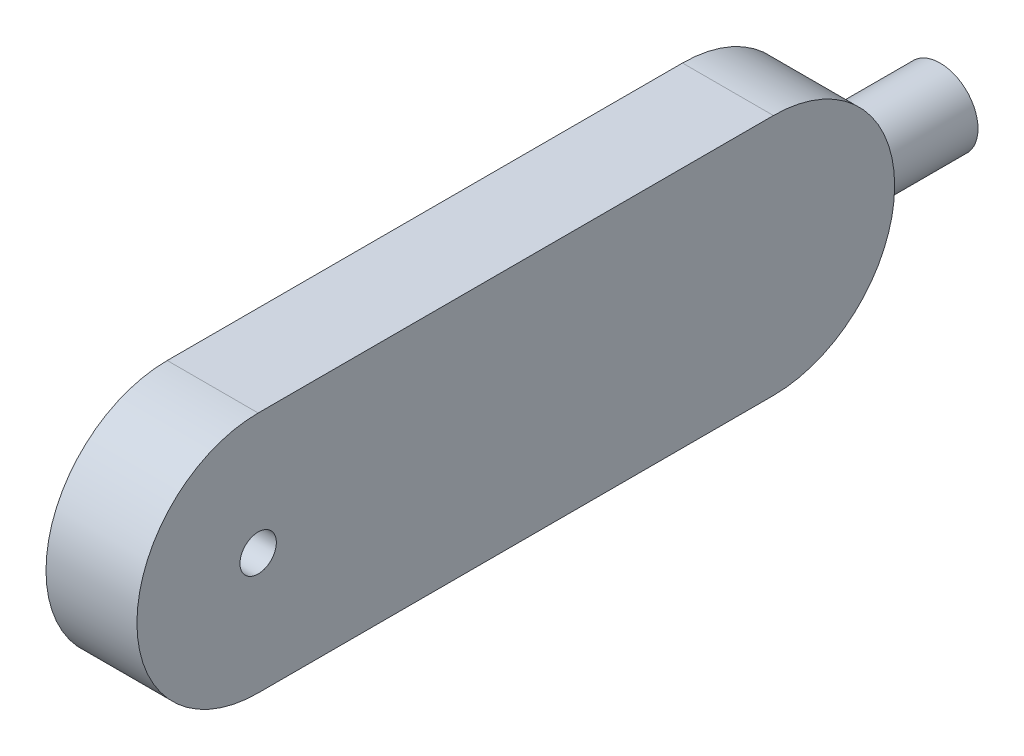
ISO-10303-21;
HEADER;
FILE_DESCRIPTION(('STEP AP214'),'2;1');
FILE_NAME('part.step','',(''),(''),'','','');
FILE_SCHEMA(('AUTOMOTIVE_DESIGN { 1 0 10303 214 1 1 1 1 }'));
ENDSEC;
DATA;
#1=APPLICATION_CONTEXT('core data for automotive mechanical design processes');
#2=APPLICATION_PROTOCOL_DEFINITION('international standard','automotive_design',2000,#1);
#3=PRODUCT_CONTEXT('',#1,'mechanical');
#4=PRODUCT('Part','Part','',(#3));
#5=PRODUCT_RELATED_PRODUCT_CATEGORY('part','',(#4));
#6=PRODUCT_DEFINITION_FORMATION('','',#4);
#7=PRODUCT_DEFINITION_CONTEXT('part definition',#1,'design');
#8=PRODUCT_DEFINITION('design','',#6,#7);
#9=PRODUCT_DEFINITION_SHAPE('','',#8);
#10=(LENGTH_UNIT() NAMED_UNIT(*) SI_UNIT(.MILLI.,.METRE.));
#11=(NAMED_UNIT(*) PLANE_ANGLE_UNIT() SI_UNIT($,.RADIAN.));
#12=(NAMED_UNIT(*) SI_UNIT($,.STERADIAN.) SOLID_ANGLE_UNIT());
#13=UNCERTAINTY_MEASURE_WITH_UNIT(LENGTH_MEASURE(1.E-05),#10,'distance_accuracy_value','');
#14=(GEOMETRIC_REPRESENTATION_CONTEXT(3) GLOBAL_UNCERTAINTY_ASSIGNED_CONTEXT((#13)) GLOBAL_UNIT_ASSIGNED_CONTEXT((#10,
#11,#12)) REPRESENTATION_CONTEXT('',''));
#15=CARTESIAN_POINT('',(0.,0.,0.));
#16=DIRECTION('',(0.,0.,1.));
#17=DIRECTION('',(1.,0.,0.));
#18=AXIS2_PLACEMENT_3D('',#15,#16,#17);
#19=CARTESIAN_POINT('',(30.,40.,-210.));
#20=DIRECTION('',(-1.,0.,0.));
#21=DIRECTION('',(0.,0.,1.));
#22=AXIS2_PLACEMENT_3D('',#19,#20,#21);
#23=CYLINDRICAL_SURFACE('',#22,40.);
#24=CARTESIAN_POINT('',(30.,40.,-210.));
#25=DIRECTION('',(-1.,0.,0.));
#26=DIRECTION('',(0.,0.,1.));
#27=AXIS2_PLACEMENT_3D('',#24,#25,#26);
#28=CIRCLE('',#27,40.);
#29=CARTESIAN_POINT('',(30.,80.0000000000001,-210.));
#30=VERTEX_POINT('',#29);
#31=CARTESIAN_POINT('',(30.,0.,-210.));
#32=VERTEX_POINT('',#31);
#33=EDGE_CURVE('E44',#30,#32,#28,.T.);
#34=ORIENTED_EDGE('',*,*,#33,.T.);
#35=DIRECTION('',(-1.,0.,0.));
#36=VECTOR('',#35,1.);
#37=CARTESIAN_POINT('',(30.,0.,-210.));
#38=LINE('',#37,#36);
#39=CARTESIAN_POINT('',(0.,0.,-210.));
#40=VERTEX_POINT('',#39);
#41=EDGE_CURVE('E11',#32,#40,#38,.T.);
#42=ORIENTED_EDGE('',*,*,#41,.T.);
#43=CARTESIAN_POINT('',(0.,40.,-210.));
#44=DIRECTION('',(-1.,0.,0.));
#45=DIRECTION('',(0.,0.,1.));
#46=AXIS2_PLACEMENT_3D('',#43,#44,#45);
#47=CIRCLE('',#46,40.);
#48=CARTESIAN_POINT('',(0.,80.0000000000001,-210.));
#49=VERTEX_POINT('',#48);
#50=EDGE_CURVE('E162',#49,#40,#47,.T.);
#51=ORIENTED_EDGE('',*,*,#50,.F.);
#52=DIRECTION('',(-1.,0.,0.));
#53=VECTOR('',#52,1.);
#54=CARTESIAN_POINT('',(30.,80.0000000000001,-210.));
#55=LINE('',#54,#53);
#56=EDGE_CURVE('E169',#30,#49,#55,.T.);
#57=ORIENTED_EDGE('',*,*,#56,.F.);
#58=EDGE_LOOP('',(#34,#42,#51,#57));
#59=FACE_BOUND('',#58,.T.);
#60=CARTESIAN_POINT('',(27.5,40.,-250.));
#61=CARTESIAN_POINT('',(27.4999996056617,40.342204552625,-249.999999737702));
#62=CARTESIAN_POINT('',(27.4859360558347,40.6844158773741,-249.995598289629));
#63=CARTESIAN_POINT('',(27.4298121177631,41.3663139805722,-249.978113060104));
#64=CARTESIAN_POINT('',(27.3877509946712,41.7060006925214,-249.965029050762));
#65=CARTESIAN_POINT('',(27.2760089579981,42.3804335728738,-249.930534374627));
#66=CARTESIAN_POINT('',(27.2063227786749,42.7151787867296,-249.909122120363));
#67=CARTESIAN_POINT('',(27.0399529136372,43.3772850049059,-249.858552315762));
#68=CARTESIAN_POINT('',(26.9432692872638,43.7046460254554,-249.82939478245));
#69=CARTESIAN_POINT('',(26.7239019769875,44.3492353136851,-249.764166487275));
#70=CARTESIAN_POINT('',(26.6012596911088,44.6664788003717,-249.728106741495));
#71=CARTESIAN_POINT('',(26.3308665018371,45.2893028500472,-249.649991067217));
#72=CARTESIAN_POINT('',(26.1831156136602,45.5948834201039,-249.607935142354));
#73=CARTESIAN_POINT('',(25.8636222369973,46.1924551322176,-249.518916494033));
#74=CARTESIAN_POINT('',(25.6918811169035,46.4844470480999,-249.471954050479));
#75=CARTESIAN_POINT('',(25.3255404162271,47.0532038603043,-249.374301459257));
#76=CARTESIAN_POINT('',(25.1309326575645,47.3299632565498,-249.323609980365));
#77=CARTESIAN_POINT('',(24.7144977557807,47.8739500199095,-249.218360192221));
#78=CARTESIAN_POINT('',(24.4920665758335,48.1407019314077,-249.163733706781));
#79=CARTESIAN_POINT('',(24.0259170027536,48.6546630298969,-249.053372579667));
#80=CARTESIAN_POINT('',(23.7821982016919,48.9018718422158,-248.997637916774));
#81=CARTESIAN_POINT('',(23.2749138770081,49.3752977293698,-248.886539375386));
#82=CARTESIAN_POINT('',(23.0113413821741,49.6015073679558,-248.831175634635));
#83=CARTESIAN_POINT('',(22.4661391038643,50.0313120377644,-248.722369752953));
#84=CARTESIAN_POINT('',(22.1845155752643,50.2349148363934,-248.668926956308));
#85=CARTESIAN_POINT('',(21.5976102981265,50.6230112633002,-248.564142024417));
#86=CARTESIAN_POINT('',(21.2919135086141,50.8069011314766,-248.512885608538));
#87=CARTESIAN_POINT('',(20.6652746853971,51.1481814348208,-248.415485942598));
#88=CARTESIAN_POINT('',(20.344332335376,51.3055713198557,-248.369342798695));
#89=CARTESIAN_POINT('',(19.6894644343749,51.5925273433765,-248.283622425114));
#90=CARTESIAN_POINT('',(19.3555415678269,51.7220991989871,-248.244043846677));
#91=CARTESIAN_POINT('',(18.6770519302637,51.9523055811873,-248.172724982613));
#92=CARTESIAN_POINT('',(18.3324855747744,52.0529412358802,-248.140984391423));
#93=CARTESIAN_POINT('',(17.6458035706646,52.2217405426102,-248.087224505286));
#94=CARTESIAN_POINT('',(17.3039263995051,52.2907905162333,-248.064941329643));
#95=CARTESIAN_POINT('',(16.6151328454856,52.4001182283762,-248.029467304444));
#96=CARTESIAN_POINT('',(16.2682165557117,52.4403964976996,-248.016276287147));
#97=CARTESIAN_POINT('',(15.5720789022629,52.4917777483029,-247.999423981715));
#98=CARTESIAN_POINT('',(15.2228580882163,52.5028874508925,-247.995760498152));
#99=CARTESIAN_POINT('',(14.5247486376196,52.495838469352,-247.99807939942));
#100=CARTESIAN_POINT('',(14.1758599933305,52.4776804846691,-248.004061553737));
#101=CARTESIAN_POINT('',(13.4948836266151,52.4135781094206,-248.025046353218));
#102=CARTESIAN_POINT('',(13.1626776040646,52.3687622737982,-248.039682490877));
#103=CARTESIAN_POINT('',(12.503399323256,52.2527143431781,-248.077220291647));
#104=CARTESIAN_POINT('',(12.1763269097549,52.1814830486078,-248.100121704307));
#105=CARTESIAN_POINT('',(11.5295053873641,52.013215811462,-248.153511304676));
#106=CARTESIAN_POINT('',(11.2097568152068,51.9161779841681,-248.184000046498));
#107=CARTESIAN_POINT('',(10.5796778896063,51.6970940790979,-248.251681297155));
#108=CARTESIAN_POINT('',(10.269347759273,51.5750474094265,-248.288873964653));
#109=CARTESIAN_POINT('',(9.65564709564353,51.3049502812852,-248.369496154931));
#110=CARTESIAN_POINT('',(9.35244100267182,51.1565508568649,-248.413007734577));
#111=CARTESIAN_POINT('',(8.75944450919762,50.8360100203328,-248.504657766042));
#112=CARTESIAN_POINT('',(8.4696591155152,50.6638598413941,-248.552797924355));
#113=CARTESIAN_POINT('',(7.90537559725413,50.297063824464,-248.652381171025));
#114=CARTESIAN_POINT('',(7.63087467622117,50.1024221217061,-248.703823651455));
#115=CARTESIAN_POINT('',(7.09856113845129,49.6917656487381,-248.80869230894));
#116=CARTESIAN_POINT('',(6.84075628572694,49.4757410514386,-248.86211939096));
#117=CARTESIAN_POINT('',(6.33210954291805,49.0133851965339,-248.972014002432));
#118=CARTESIAN_POINT('',(6.0821204294919,48.7661214279688,-249.028509130431));
#119=CARTESIAN_POINT('',(5.60386051047165,48.2514196954554,-249.140559522952));
#120=CARTESIAN_POINT('',(5.37558057577131,47.9839902971064,-249.196115174387));
#121=CARTESIAN_POINT('',(4.9420269626788,47.4303999606108,-249.304818406117));
#122=CARTESIAN_POINT('',(4.73676502611186,47.144229579243,-249.357964749228));
#123=CARTESIAN_POINT('',(4.35091078127085,46.5552119015168,-249.460340885591));
#124=CARTESIAN_POINT('',(4.17030860758095,46.2523713426892,-249.509572241768));
#125=CARTESIAN_POINT('',(3.83369011615488,45.629376668092,-249.603157898623));
#126=CARTESIAN_POINT('',(3.67788333495294,45.3091028406018,-249.647469765822));
#127=CARTESIAN_POINT('',(3.39390869437372,44.6556991771743,-249.729496167291));
#128=CARTESIAN_POINT('',(3.26574112710037,44.3225692054112,-249.767210631835));
#129=CARTESIAN_POINT('',(3.03820643329684,43.645937480188,-249.834943242045));
#130=CARTESIAN_POINT('',(2.93883220877904,43.3024383059846,-249.864963284289));
#131=CARTESIAN_POINT('',(2.76977714412388,42.6075820350319,-249.916435923617));
#132=CARTESIAN_POINT('',(2.7000951184157,42.2562252526163,-249.937888862772));
#133=CARTESIAN_POINT('',(2.59321120080099,41.5620830306927,-249.970938609816));
#134=CARTESIAN_POINT('',(2.55485819440914,41.2194910704738,-249.982884264877));
#135=CARTESIAN_POINT('',(2.50658006627312,40.5321191529182,-249.997937571523));
#136=CARTESIAN_POINT('',(2.49665421149066,40.1873392522307,-250.001045451004));
#137=CARTESIAN_POINT('',(2.50532331639912,39.4982207932294,-249.998336593584));
#138=CARTESIAN_POINT('',(2.5239145272121,39.1538821828587,-249.992521029766));
#139=CARTESIAN_POINT('',(2.58943449397409,38.4681768887854,-249.972129891384));
#140=CARTESIAN_POINT('',(2.63636302011259,38.126810181004,-249.957554387863));
#141=CARTESIAN_POINT('',(2.75660085611414,37.4580062250318,-249.920516595984));
#142=CARTESIAN_POINT('',(2.82922382740818,37.1304338227113,-249.898259833763));
#143=CARTESIAN_POINT('',(3.00037278256588,36.4827359804344,-249.846385127742));
#144=CARTESIAN_POINT('',(3.09889821565819,36.1626103822921,-249.816767340463));
#145=CARTESIAN_POINT('',(3.32104010495878,35.5319280892571,-249.750935333772));
#146=CARTESIAN_POINT('',(3.44465420238992,35.2213704979621,-249.714721734517));
#147=CARTESIAN_POINT('',(3.71608065070104,34.6116256380498,-249.636598559831));
#148=CARTESIAN_POINT('',(3.86390229129684,34.3124427890467,-249.594686798767));
#149=CARTESIAN_POINT('',(4.18646873022521,33.7203582330706,-249.505162753037));
#150=CARTESIAN_POINT('',(4.36177370349536,33.4277787337361,-249.457437952457));
#151=CARTESIAN_POINT('',(4.73545137264236,32.858213809954,-249.358334577676));
#152=CARTESIAN_POINT('',(4.93383440364143,32.5812354552672,-249.306954370494));
#153=CARTESIAN_POINT('',(5.35234290391123,32.0445915634414,-249.201865549148));
#154=CARTESIAN_POINT('',(5.57247344680007,31.7849300900498,-249.148156393296));
#155=CARTESIAN_POINT('',(6.03296076865145,31.2846254499526,-249.039822544562));
#156=CARTESIAN_POINT('',(6.27330915950773,31.0439744756272,-248.985198238824));
#157=CARTESIAN_POINT('',(6.78289652841533,30.5737509247289,-248.874239669848));
#158=CARTESIAN_POINT('',(7.05290755309318,30.3450096138351,-248.817924678384));
#159=CARTESIAN_POINT('',(7.61151684955491,29.9111275140519,-248.707425233031));
#160=CARTESIAN_POINT('',(7.90010834721492,29.7059781990761,-248.653240014138));
#161=CARTESIAN_POINT('',(8.49419534139406,29.3205855568192,-248.548540873321));
#162=CARTESIAN_POINT('',(8.79969432288565,29.1403473912037,-248.498027713284));
#163=CARTESIAN_POINT('',(9.42554736360097,28.8061933187306,-248.402199421247));
#164=CARTESIAN_POINT('',(9.74590116684351,28.6522769585047,-248.356884199722));
#165=CARTESIAN_POINT('',(10.398033470528,28.3725630311786,-248.273018727834));
#166=CARTESIAN_POINT('',(10.7297629691724,28.2466589683005,-248.234442980184));
#167=CARTESIAN_POINT('',(11.4034739719834,28.0233170330599,-248.165072470036));
#168=CARTESIAN_POINT('',(11.7454554917129,27.9258792039125,-248.134277719351));
#169=CARTESIAN_POINT('',(12.4370189931281,27.7604127922651,-248.081492322661));
#170=CARTESIAN_POINT('',(12.7865985150505,27.6923748365712,-248.059498870813));
#171=CARTESIAN_POINT('',(13.4907454890051,27.586342180196,-248.025047310885));
#172=CARTESIAN_POINT('',(13.8453127288548,27.5483462054088,-248.01258879842));
#173=CARTESIAN_POINT('',(14.5404939012212,27.5038154364342,-247.997972071402));
#174=CARTESIAN_POINT('',(14.881013030276,27.495934526288,-247.99537318084));
#175=CARTESIAN_POINT('',(15.5614985911615,27.5079821112051,-247.99933595434));
#176=CARTESIAN_POINT('',(15.9014650401605,27.5279097252452,-248.005897328188));
#177=CARTESIAN_POINT('',(16.5783295761709,27.5953819181301,-248.02797263343));
#178=CARTESIAN_POINT('',(16.915227819557,27.642925081425,-248.043486105947));
#179=CARTESIAN_POINT('',(17.5835484384714,27.765185764217,-248.082980959241));
#180=CARTESIAN_POINT('',(17.9149707907761,27.8399033989321,-248.106962375923));
#181=CARTESIAN_POINT('',(18.5652095575826,28.0145527626659,-248.162249728763));
#182=CARTESIAN_POINT('',(18.8841396566493,28.1140977530017,-248.193442828228));
#183=CARTESIAN_POINT('',(19.5123738212461,28.338109114404,-248.262436203978));
#184=CARTESIAN_POINT('',(19.821678029968,28.4625751145482,-248.300236381924));
#185=CARTESIAN_POINT('',(20.4287505314569,28.7354794792045,-248.381386488284));
#186=CARTESIAN_POINT('',(20.7265190688399,28.8839173350435,-248.424736298935));
#187=CARTESIAN_POINT('',(21.3088813360296,29.2037770556347,-248.515830782969));
#188=CARTESIAN_POINT('',(21.5934699387583,29.3752077653819,-248.563577145412));
#189=CARTESIAN_POINT('',(22.1584707736497,29.746950120393,-248.6641106433));
#190=CARTESIAN_POINT('',(22.4382946049492,29.9481230352361,-248.717021375609));
#191=CARTESIAN_POINT('',(22.9802820765147,30.3727638458172,-248.824789970608));
#192=CARTESIAN_POINT('',(23.2424375882644,30.5962418875668,-248.879648712018));
#193=CARTESIAN_POINT('',(23.7474355579689,31.0640686253922,-248.989830479229));
#194=CARTESIAN_POINT('',(23.9902731197808,31.3084225801373,-249.045153618829));
#195=CARTESIAN_POINT('',(24.4549596214394,31.8163473727777,-249.15476077294));
#196=CARTESIAN_POINT('',(24.6768176222318,32.0799098267423,-249.209045227897));
#197=CARTESIAN_POINT('',(25.1052331109306,32.6338022460567,-249.3169344516));
#198=CARTESIAN_POINT('',(25.3110393678867,32.924729986014,-249.370457003797));
#199=CARTESIAN_POINT('',(25.697281712505,33.5235009263792,-249.473373158274));
#200=CARTESIAN_POINT('',(25.8777275298166,33.8313375762156,-249.522768341072));
#201=CARTESIAN_POINT('',(26.2119205812658,34.461935881258,-249.616049908321));
#202=CARTESIAN_POINT('',(26.3656710090364,34.7846957453061,-249.659936951549));
#203=CARTESIAN_POINT('',(26.6452050028037,35.4429153363471,-249.740947267933));
#204=CARTESIAN_POINT('',(26.7709908232136,35.7783740370488,-249.778071086273));
#205=CARTESIAN_POINT('',(26.9840700831615,36.4307340985442,-249.841667897623));
#206=CARTESIAN_POINT('',(27.0737188940251,36.746806286173,-249.868776042445));
#207=CARTESIAN_POINT('',(27.227937867332,37.3855298980223,-249.91574953331));
#208=CARTESIAN_POINT('',(27.29250970218,37.7081808819864,-249.935615362343));
#209=CARTESIAN_POINT('',(27.3960347981415,38.357893539147,-249.967602530027));
#210=CARTESIAN_POINT('',(27.4349923768555,38.6849544595043,-249.979725173878));
#211=CARTESIAN_POINT('',(27.4869756856312,39.3413414358407,-249.995924195837));
#212=CARTESIAN_POINT('',(27.5000003795051,39.6706675818029,-250.000000252432));
#213=CARTESIAN_POINT('',(27.5,40.,-250.));
#214=B_SPLINE_CURVE_WITH_KNOTS('',3,(#60,#61,#62,#63,#64,#65,#66,#67,#68,#69,#70,#71,#72,#73,
#74,#75,#76,#77,#78,#79,#80,#81,#82,#83,#84,#85,#86,#87,#88,#89,#90,#91,#92,#93,#94,#95,#96,#97,
#98,#99,#100,#101,#102,#103,#104,#105,#106,#107,#108,#109,#110,#111,#112,#113,#114,#115,#116,
#117,#118,#119,#120,#121,#122,#123,#124,#125,#126,#127,#128,#129,#130,#131,#132,#133,#134,#135,
#136,#137,#138,#139,#140,#141,#142,#143,#144,#145,#146,#147,#148,#149,#150,#151,#152,#153,#154,
#155,#156,#157,#158,#159,#160,#161,#162,#163,#164,#165,#166,#167,#168,#169,#170,#171,#172,#173,
#174,#175,#176,#177,#178,#179,#180,#181,#182,#183,#184,#185,#186,#187,#188,#189,#190,#191,#192,
#193,#194,#195,#196,#197,#198,#199,#200,#201,#202,#203,#204,#205,#206,#207,#208,#209,#210,#211,
#212,#213),.UNSPECIFIED.,.T.,.F.,(4,2,2,2,2,2,2,2,2,2,2,2,2,2,2,2,2,2,2,2,2,2,2,2,2,2,2,2,2,2,2,
2,2,2,2,2,2,2,2,2,2,2,2,2,2,2,2,2,2,2,2,2,2,2,2,2,2,2,2,2,2,2,2,2,2,2,2,2,2,2,2,2,2,2,2,2,4),
(0.,1.02630959916234,2.05264613675367,3.07917840332352,4.10570841356284,5.13061351830918,
6.15551800194825,7.18036404933668,8.20557774720253,9.25915124243171,10.3127449314334,
11.3667103081117,12.4203124285004,13.5002106704207,14.5801313279847,15.659829828767,
16.7394862308462,17.7866412467546,18.8337769433998,19.8806713274907,20.9275406929821,
21.9329633938096,22.9383556313389,23.9438213154656,24.9493107991377,25.9692712386319,
26.9896091760242,28.0097598143176,29.0303814867492,30.0975165904252,31.1642009413688,
32.2314269722449,33.2982247884769,34.3736071034722,35.4490007830456,36.524129136082,
37.5992145566204,38.6327538819043,39.66626655553,40.6996433743359,41.7330118127549,
42.7406363909147,43.748239545402,44.7557480112601,45.7636440213957,46.7956870741859,
47.8281941024645,48.8609425824004,49.8932646827888,50.9669846921249,52.0403154341887,
53.1138682412855,54.1874025555816,55.2567830400581,56.3261651479733,57.3952060661692,
58.4642016430058,59.484813852563,60.5053937280571,61.5259212940958,62.5464531871557,
63.551985280699,64.5575024090989,65.5629982036429,66.5688819122281,67.6137144215776,
68.6590243825341,69.7045984392212,70.7497188363487,71.8294924339708,72.9088506339785,
73.9880796186885,75.0672215679916,76.0551191873127,77.0429509115922,78.0306160818691,
79.0183207150143),.UNSPECIFIED.);
#215=CARTESIAN_POINT('',(27.5,40.,-250.));
#216=VERTEX_POINT('',#215);
#217=EDGE_CURVE('E147',#216,#216,#214,.T.);
#218=ORIENTED_EDGE('',*,*,#217,.T.);
#219=EDGE_LOOP('',(#218));
#220=FACE_BOUND('',#219,.T.);
#221=ADVANCED_FACE('F35',(#59,#220),#23,.T.);
#222=CARTESIAN_POINT('',(30.,0.,-250.));
#223=DIRECTION('',(0.,1.,0.));
#224=DIRECTION('',(0.,0.,1.));
#225=AXIS2_PLACEMENT_3D('',#222,#223,#224);
#226=PLANE('',#225);
#227=ORIENTED_EDGE('',*,*,#41,.F.);
#228=DIRECTION('',(0.,0.,-1.));
#229=VECTOR('',#228,1.);
#230=CARTESIAN_POINT('',(30.,0.,-250.));
#231=LINE('',#230,#229);
#232=CARTESIAN_POINT('',(30.,0.,-40.));
#233=VERTEX_POINT('',#232);
#234=EDGE_CURVE('E39',#233,#32,#231,.T.);
#235=ORIENTED_EDGE('',*,*,#234,.F.);
#236=DIRECTION('',(-1.,0.,0.));
#237=VECTOR('',#236,1.);
#238=CARTESIAN_POINT('',(30.,0.,-40.));
#239=LINE('',#238,#237);
#240=CARTESIAN_POINT('',(0.,0.,-40.));
#241=VERTEX_POINT('',#240);
#242=EDGE_CURVE('E89',#233,#241,#239,.T.);
#243=ORIENTED_EDGE('',*,*,#242,.T.);
#244=DIRECTION('',(0.,0.,-1.));
#245=VECTOR('',#244,1.);
#246=CARTESIAN_POINT('',(0.,0.,-250.));
#247=LINE('',#246,#245);
#248=EDGE_CURVE('E166',#241,#40,#247,.T.);
#249=ORIENTED_EDGE('',*,*,#248,.T.);
#250=EDGE_LOOP('',(#227,#235,#243,#249));
#251=FACE_BOUND('',#250,.T.);
#252=ADVANCED_FACE('F37',(#251),#226,.F.);
#253=CARTESIAN_POINT('',(30.,80.,0.));
#254=DIRECTION('',(0.,-1.,0.));
#255=DIRECTION('',(0.,0.,-1.));
#256=AXIS2_PLACEMENT_3D('',#253,#254,#255);
#257=PLANE('',#256);
#258=DIRECTION('',(0.,0.,1.));
#259=VECTOR('',#258,1.);
#260=CARTESIAN_POINT('',(30.,80.,0.));
#261=LINE('',#260,#259);
#262=CARTESIAN_POINT('',(30.,80.,-40.));
#263=VERTEX_POINT('',#262);
#264=EDGE_CURVE('E177',#30,#263,#261,.T.);
#265=ORIENTED_EDGE('',*,*,#264,.F.);
#266=ORIENTED_EDGE('',*,*,#56,.T.);
#267=DIRECTION('',(0.,0.,1.));
#268=VECTOR('',#267,1.);
#269=CARTESIAN_POINT('',(0.,80.,0.));
#270=LINE('',#269,#268);
#271=CARTESIAN_POINT('',(0.,80.,-40.));
#272=VERTEX_POINT('',#271);
#273=EDGE_CURVE('E172',#49,#272,#270,.T.);
#274=ORIENTED_EDGE('',*,*,#273,.T.);
#275=DIRECTION('',(-1.,0.,0.));
#276=VECTOR('',#275,1.);
#277=CARTESIAN_POINT('',(30.,80.,-40.));
#278=LINE('',#277,#276);
#279=EDGE_CURVE('E163',#263,#272,#278,.T.);
#280=ORIENTED_EDGE('',*,*,#279,.F.);
#281=EDGE_LOOP('',(#265,#266,#274,#280));
#282=FACE_BOUND('',#281,.T.);
#283=ADVANCED_FACE('F226',(#282),#257,.F.);
#284=CARTESIAN_POINT('',(30.,0.,0.));
#285=DIRECTION('',(-1.,0.,0.));
#286=DIRECTION('',(0.,0.,1.));
#287=AXIS2_PLACEMENT_3D('',#284,#285,#286);
#288=PLANE('',#287);
#289=CARTESIAN_POINT('',(30.,40.,-40.));
#290=DIRECTION('',(1.,0.,0.));
#291=DIRECTION('',(0.,0.,-1.));
#292=AXIS2_PLACEMENT_3D('',#289,#290,#291);
#293=CIRCLE('',#292,6.);
#294=CARTESIAN_POINT('',(30.,40.,-46.));
#295=VERTEX_POINT('',#294);
#296=EDGE_CURVE('E155',#295,#295,#293,.T.);
#297=ORIENTED_EDGE('',*,*,#296,.F.);
#298=EDGE_LOOP('',(#297));
#299=FACE_BOUND('',#298,.T.);
#300=ORIENTED_EDGE('',*,*,#33,.F.);
#301=ORIENTED_EDGE('',*,*,#264,.T.);
#302=CARTESIAN_POINT('',(30.,40.,-40.));
#303=DIRECTION('',(-1.,0.,0.));
#304=DIRECTION('',(0.,0.,1.));
#305=AXIS2_PLACEMENT_3D('',#302,#303,#304);
#306=CIRCLE('',#305,40.);
#307=EDGE_CURVE('E158',#233,#263,#306,.T.);
#308=ORIENTED_EDGE('',*,*,#307,.F.);
#309=ORIENTED_EDGE('',*,*,#234,.T.);
#310=EDGE_LOOP('',(#300,#301,#308,#309));
#311=FACE_BOUND('',#310,.T.);
#312=ADVANCED_FACE('F227',(#299,#311),#288,.F.);
#313=CARTESIAN_POINT('',(0.,0.,0.));
#314=DIRECTION('',(-1.,0.,0.));
#315=DIRECTION('',(0.,0.,1.));
#316=AXIS2_PLACEMENT_3D('',#313,#314,#315);
#317=PLANE('',#316);
#318=DIRECTION('',(0.,-1.,0.));
#319=VECTOR('',#318,1.);
#320=CARTESIAN_POINT('',(0.,50.0000000000001,-230.));
#321=LINE('',#320,#319);
#322=CARTESIAN_POINT('',(0.,50.0000000000001,-230.));
#323=VERTEX_POINT('',#322);
#324=CARTESIAN_POINT('',(0.,30.0000000000001,-230.));
#325=VERTEX_POINT('',#324);
#326=EDGE_CURVE('E145',#323,#325,#321,.T.);
#327=ORIENTED_EDGE('',*,*,#326,.F.);
#328=DIRECTION('',(0.,0.,-1.));
#329=VECTOR('',#328,1.);
#330=CARTESIAN_POINT('',(0.,50.0000000000001,-230.));
#331=LINE('',#330,#329);
#332=CARTESIAN_POINT('',(0.,50.0000000000001,-190.));
#333=VERTEX_POINT('',#332);
#334=EDGE_CURVE('E140',#333,#323,#331,.T.);
#335=ORIENTED_EDGE('',*,*,#334,.F.);
#336=DIRECTION('',(0.,1.,0.));
#337=VECTOR('',#336,1.);
#338=CARTESIAN_POINT('',(0.,50.0000000000001,-190.));
#339=LINE('',#338,#337);
#340=CARTESIAN_POINT('',(0.,30.0000000000001,-190.));
#341=VERTEX_POINT('',#340);
#342=EDGE_CURVE('E149',#341,#333,#339,.T.);
#343=ORIENTED_EDGE('',*,*,#342,.F.);
#344=DIRECTION('',(0.,0.,1.));
#345=VECTOR('',#344,1.);
#346=CARTESIAN_POINT('',(0.,30.0000000000001,-230.));
#347=LINE('',#346,#345);
#348=EDGE_CURVE('E127',#325,#341,#347,.T.);
#349=ORIENTED_EDGE('',*,*,#348,.F.);
#350=EDGE_LOOP('',(#327,#335,#343,#349));
#351=FACE_BOUND('',#350,.T.);
#352=CARTESIAN_POINT('',(0.,40.,-40.));
#353=DIRECTION('',(1.,0.,0.));
#354=DIRECTION('',(0.,0.,-1.));
#355=AXIS2_PLACEMENT_3D('',#352,#353,#354);
#356=CIRCLE('',#355,6.);
#357=CARTESIAN_POINT('',(0.,40.,-46.));
#358=VERTEX_POINT('',#357);
#359=EDGE_CURVE('E159',#358,#358,#356,.T.);
#360=ORIENTED_EDGE('',*,*,#359,.T.);
#361=EDGE_LOOP('',(#360));
#362=FACE_BOUND('',#361,.T.);
#363=ORIENTED_EDGE('',*,*,#273,.F.);
#364=ORIENTED_EDGE('',*,*,#50,.T.);
#365=ORIENTED_EDGE('',*,*,#248,.F.);
#366=CARTESIAN_POINT('',(0.,40.,-40.));
#367=DIRECTION('',(-1.,0.,0.));
#368=DIRECTION('',(0.,0.,1.));
#369=AXIS2_PLACEMENT_3D('',#366,#367,#368);
#370=CIRCLE('',#369,40.);
#371=EDGE_CURVE('E79',#241,#272,#370,.T.);
#372=ORIENTED_EDGE('',*,*,#371,.T.);
#373=EDGE_LOOP('',(#363,#364,#365,#372));
#374=FACE_BOUND('',#373,.T.);
#375=ADVANCED_FACE('F181',(#351,#362,#374),#317,.T.);
#376=CARTESIAN_POINT('',(0.,40.,-40.));
#377=DIRECTION('',(1.,0.,0.));
#378=DIRECTION('',(0.,0.,-1.));
#379=AXIS2_PLACEMENT_3D('',#376,#377,#378);
#380=CYLINDRICAL_SURFACE('',#379,6.);
#381=ORIENTED_EDGE('',*,*,#359,.F.);
#382=EDGE_LOOP('',(#381));
#383=FACE_BOUND('',#382,.T.);
#384=ORIENTED_EDGE('',*,*,#296,.T.);
#385=EDGE_LOOP('',(#384));
#386=FACE_BOUND('',#385,.T.);
#387=ADVANCED_FACE('F217',(#383,#386),#380,.F.);
#388=CARTESIAN_POINT('',(30.,40.,-40.));
#389=DIRECTION('',(-1.,0.,0.));
#390=DIRECTION('',(0.,0.,1.));
#391=AXIS2_PLACEMENT_3D('',#388,#389,#390);
#392=CYLINDRICAL_SURFACE('',#391,40.);
#393=ORIENTED_EDGE('',*,*,#307,.T.);
#394=ORIENTED_EDGE('',*,*,#279,.T.);
#395=ORIENTED_EDGE('',*,*,#371,.F.);
#396=ORIENTED_EDGE('',*,*,#242,.F.);
#397=EDGE_LOOP('',(#393,#394,#395,#396));
#398=FACE_BOUND('',#397,.T.);
#399=ADVANCED_FACE('F216',(#398),#392,.T.);
#400=CARTESIAN_POINT('',(25.,50.0000000000001,-230.));
#401=DIRECTION('',(0.,0.,-1.));
#402=DIRECTION('',(-1.,0.,0.));
#403=AXIS2_PLACEMENT_3D('',#400,#401,#402);
#404=PLANE('',#403);
#405=ORIENTED_EDGE('',*,*,#326,.T.);
#406=DIRECTION('',(-1.,0.,0.));
#407=VECTOR('',#406,1.);
#408=CARTESIAN_POINT('',(25.,30.0000000000001,-230.));
#409=LINE('',#408,#407);
#410=CARTESIAN_POINT('',(25.,30.0000000000001,-230.));
#411=VERTEX_POINT('',#410);
#412=EDGE_CURVE('E52',#411,#325,#409,.T.);
#413=ORIENTED_EDGE('',*,*,#412,.F.);
#414=DIRECTION('',(0.,-1.,0.));
#415=VECTOR('',#414,1.);
#416=CARTESIAN_POINT('',(25.,50.0000000000001,-230.));
#417=LINE('',#416,#415);
#418=CARTESIAN_POINT('',(25.,50.0000000000001,-230.));
#419=VERTEX_POINT('',#418);
#420=EDGE_CURVE('E120',#419,#411,#417,.T.);
#421=ORIENTED_EDGE('',*,*,#420,.F.);
#422=DIRECTION('',(-1.,0.,0.));
#423=VECTOR('',#422,1.);
#424=CARTESIAN_POINT('',(25.,50.0000000000001,-230.));
#425=LINE('',#424,#423);
#426=EDGE_CURVE('E99',#419,#323,#425,.T.);
#427=ORIENTED_EDGE('',*,*,#426,.T.);
#428=EDGE_LOOP('',(#405,#413,#421,#427));
#429=FACE_BOUND('',#428,.T.);
#430=ADVANCED_FACE('F209',(#429),#404,.F.);
#431=CARTESIAN_POINT('',(25.,50.0000000000001,-230.));
#432=DIRECTION('',(0.,1.,0.));
#433=DIRECTION('',(0.,0.,1.));
#434=AXIS2_PLACEMENT_3D('',#431,#432,#433);
#435=PLANE('',#434);
#436=ORIENTED_EDGE('',*,*,#334,.T.);
#437=ORIENTED_EDGE('',*,*,#426,.F.);
#438=DIRECTION('',(0.,0.,-1.));
#439=VECTOR('',#438,1.);
#440=CARTESIAN_POINT('',(25.,50.0000000000001,-230.));
#441=LINE('',#440,#439);
#442=CARTESIAN_POINT('',(25.,50.0000000000001,-190.));
#443=VERTEX_POINT('',#442);
#444=EDGE_CURVE('E136',#443,#419,#441,.T.);
#445=ORIENTED_EDGE('',*,*,#444,.F.);
#446=DIRECTION('',(-1.,0.,0.));
#447=VECTOR('',#446,1.);
#448=CARTESIAN_POINT('',(25.,50.0000000000001,-190.));
#449=LINE('',#448,#447);
#450=EDGE_CURVE('E131',#443,#333,#449,.T.);
#451=ORIENTED_EDGE('',*,*,#450,.T.);
#452=EDGE_LOOP('',(#436,#437,#445,#451));
#453=FACE_BOUND('',#452,.T.);
#454=ADVANCED_FACE('F206',(#453),#435,.F.);
#455=CARTESIAN_POINT('',(25.,50.0000000000001,-190.));
#456=DIRECTION('',(0.,0.,1.));
#457=DIRECTION('',(1.,0.,0.));
#458=AXIS2_PLACEMENT_3D('',#455,#456,#457);
#459=PLANE('',#458);
#460=ORIENTED_EDGE('',*,*,#342,.T.);
#461=ORIENTED_EDGE('',*,*,#450,.F.);
#462=DIRECTION('',(0.,1.,0.));
#463=VECTOR('',#462,1.);
#464=CARTESIAN_POINT('',(25.,50.0000000000001,-190.));
#465=LINE('',#464,#463);
#466=CARTESIAN_POINT('',(25.,30.0000000000001,-190.));
#467=VERTEX_POINT('',#466);
#468=EDGE_CURVE('E134',#467,#443,#465,.T.);
#469=ORIENTED_EDGE('',*,*,#468,.F.);
#470=DIRECTION('',(-1.,0.,0.));
#471=VECTOR('',#470,1.);
#472=CARTESIAN_POINT('',(25.,30.0000000000001,-190.));
#473=LINE('',#472,#471);
#474=EDGE_CURVE('E122',#467,#341,#473,.T.);
#475=ORIENTED_EDGE('',*,*,#474,.T.);
#476=EDGE_LOOP('',(#460,#461,#469,#475));
#477=FACE_BOUND('',#476,.T.);
#478=ADVANCED_FACE('F135',(#477),#459,.F.);
#479=CARTESIAN_POINT('',(25.,30.0000000000001,-230.));
#480=DIRECTION('',(0.,-1.,0.));
#481=DIRECTION('',(0.,0.,-1.));
#482=AXIS2_PLACEMENT_3D('',#479,#480,#481);
#483=PLANE('',#482);
#484=ORIENTED_EDGE('',*,*,#348,.T.);
#485=ORIENTED_EDGE('',*,*,#474,.F.);
#486=DIRECTION('',(0.,0.,1.));
#487=VECTOR('',#486,1.);
#488=CARTESIAN_POINT('',(25.,30.0000000000001,-230.));
#489=LINE('',#488,#487);
#490=EDGE_CURVE('E125',#411,#467,#489,.T.);
#491=ORIENTED_EDGE('',*,*,#490,.F.);
#492=ORIENTED_EDGE('',*,*,#412,.T.);
#493=EDGE_LOOP('',(#484,#485,#491,#492));
#494=FACE_BOUND('',#493,.T.);
#495=ADVANCED_FACE('F124',(#494),#483,.F.);
#496=CARTESIAN_POINT('',(25.,0.,0.));
#497=DIRECTION('',(-1.,0.,0.));
#498=DIRECTION('',(0.,0.,1.));
#499=AXIS2_PLACEMENT_3D('',#496,#497,#498);
#500=PLANE('',#499);
#501=ORIENTED_EDGE('',*,*,#420,.T.);
#502=ORIENTED_EDGE('',*,*,#490,.T.);
#503=ORIENTED_EDGE('',*,*,#468,.T.);
#504=ORIENTED_EDGE('',*,*,#444,.T.);
#505=EDGE_LOOP('',(#501,#502,#503,#504));
#506=FACE_BOUND('',#505,.T.);
#507=ADVANCED_FACE('F138',(#506),#500,.T.);
#508=CARTESIAN_POINT('',(15.,40.,-280.));
#509=DIRECTION('',(0.,0.,1.));
#510=DIRECTION('',(1.,0.,0.));
#511=AXIS2_PLACEMENT_3D('',#508,#509,#510);
#512=CYLINDRICAL_SURFACE('',#511,12.5);
#513=ORIENTED_EDGE('',*,*,#217,.F.);
#514=EDGE_LOOP('',(#513));
#515=FACE_BOUND('',#514,.T.);
#516=CARTESIAN_POINT('',(15.,40.,-280.));
#517=DIRECTION('',(0.,0.,-1.));
#518=DIRECTION('',(-1.,0.,0.));
#519=AXIS2_PLACEMENT_3D('',#516,#517,#518);
#520=CIRCLE('',#519,12.5);
#521=CARTESIAN_POINT('',(2.5,40.,-280.));
#522=VERTEX_POINT('',#521);
#523=EDGE_CURVE('E188',#522,#522,#520,.T.);
#524=ORIENTED_EDGE('',*,*,#523,.F.);
#525=EDGE_LOOP('',(#524));
#526=FACE_BOUND('',#525,.T.);
#527=ADVANCED_FACE('F198',(#515,#526),#512,.T.);
#528=CARTESIAN_POINT('',(15.,40.,-280.));
#529=DIRECTION('',(0.,0.,-1.));
#530=DIRECTION('',(-1.,0.,0.));
#531=AXIS2_PLACEMENT_3D('',#528,#529,#530);
#532=PLANE('',#531);
#533=ORIENTED_EDGE('',*,*,#523,.T.);
#534=EDGE_LOOP('',(#533));
#535=FACE_BOUND('',#534,.T.);
#536=ADVANCED_FACE('F203',(#535),#532,.T.);
#537=CLOSED_SHELL('',(#221,#252,#283,#312,#375,#387,#399,#430,#454,#478,#495,#507,#527,#536));
#538=MANIFOLD_SOLID_BREP('B2',#537);
#539=ADVANCED_BREP_SHAPE_REPRESENTATION('',(#18,#538),#14);
#540=SHAPE_DEFINITION_REPRESENTATION(#9,#539);
ENDSEC;
END-ISO-10303-21;
